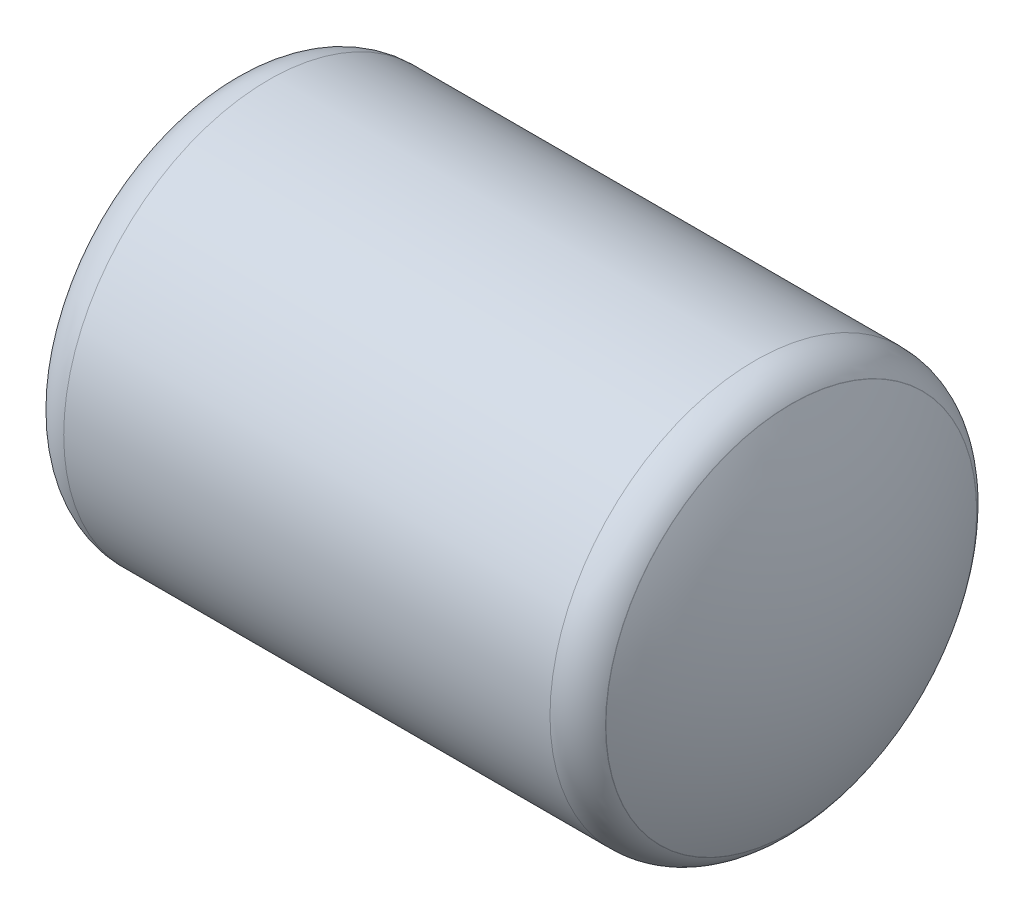
ISO-10303-21;
HEADER;
FILE_DESCRIPTION(('STEP AP214'),'2;1');
FILE_NAME('part.step','',(''),(''),'','','');
FILE_SCHEMA(('AUTOMOTIVE_DESIGN { 1 0 10303 214 1 1 1 1 }'));
ENDSEC;
DATA;
#1=APPLICATION_CONTEXT('core data for automotive mechanical design processes');
#2=APPLICATION_PROTOCOL_DEFINITION('international standard','automotive_design',2000,#1);
#3=PRODUCT_CONTEXT('',#1,'mechanical');
#4=PRODUCT('Part','Part','',(#3));
#5=PRODUCT_RELATED_PRODUCT_CATEGORY('part','',(#4));
#6=PRODUCT_DEFINITION_FORMATION('','',#4);
#7=PRODUCT_DEFINITION_CONTEXT('part definition',#1,'design');
#8=PRODUCT_DEFINITION('design','',#6,#7);
#9=PRODUCT_DEFINITION_SHAPE('','',#8);
#10=(LENGTH_UNIT() NAMED_UNIT(*) SI_UNIT(.MILLI.,.METRE.));
#11=(NAMED_UNIT(*) PLANE_ANGLE_UNIT() SI_UNIT($,.RADIAN.));
#12=(NAMED_UNIT(*) SI_UNIT($,.STERADIAN.) SOLID_ANGLE_UNIT());
#13=UNCERTAINTY_MEASURE_WITH_UNIT(LENGTH_MEASURE(1.E-05),#10,'distance_accuracy_value','');
#14=(GEOMETRIC_REPRESENTATION_CONTEXT(3) GLOBAL_UNCERTAINTY_ASSIGNED_CONTEXT((#13)) GLOBAL_UNIT_ASSIGNED_CONTEXT((#10,
#11,#12)) REPRESENTATION_CONTEXT('',''));
#15=CARTESIAN_POINT('',(0.,0.,0.));
#16=DIRECTION('',(0.,0.,1.));
#17=DIRECTION('',(1.,0.,0.));
#18=AXIS2_PLACEMENT_3D('',#15,#16,#17);
#19=CARTESIAN_POINT('',(24269.2202488997,4656.14444820347,0.));
#20=DIRECTION('',(-1.,0.,0.));
#21=DIRECTION('',(0.,1.,0.));
#22=AXIS2_PLACEMENT_3D('',#19,#20,#21);
#23=SPHERICAL_SURFACE('',#22,1308.);
#24=CARTESIAN_POINT('',(25434.2224775123,4656.14444820347,0.));
#25=DIRECTION('',(-1.,0.,0.));
#26=DIRECTION('',(0.,0.,1.));
#27=AXIS2_PLACEMENT_3D('',#24,#25,#26);
#28=CIRCLE('',#27,594.671175800313);
#29=CARTESIAN_POINT('',(25434.2224775123,4656.14444820347,594.671175800313));
#30=VERTEX_POINT('',#29);
#31=EDGE_CURVE('E66',#30,#30,#28,.T.);
#32=ORIENTED_EDGE('',*,*,#31,.F.);
#33=EDGE_LOOP('',(#32));
#34=FACE_BOUND('',#33,.T.);
#35=ADVANCED_FACE('F36',(#34),#23,.T.);
#36=CARTESIAN_POINT('',(25434.2224775123,4656.14444820347,0.));
#37=DIRECTION('',(-1.,0.,0.));
#38=DIRECTION('',(0.,0.,1.));
#39=AXIS2_PLACEMENT_3D('',#36,#37,#38);
#40=CONICAL_SURFACE('',#39,594.671175800313,1.04577216987342);
#41=CARTESIAN_POINT('',(25433.7971944018,4656.14444820347,0.));
#42=DIRECTION('',(-1.,0.,0.));
#43=DIRECTION('',(0.,0.,1.));
#44=AXIS2_PLACEMENT_3D('',#41,#42,#43);
#45=CIRCLE('',#44,595.405368962806);
#46=CARTESIAN_POINT('',(25433.7971944018,4656.14444820347,595.405368962806));
#47=VERTEX_POINT('',#46);
#48=EDGE_CURVE('E69',#47,#47,#45,.T.);
#49=ORIENTED_EDGE('',*,*,#48,.F.);
#50=EDGE_LOOP('',(#49));
#51=FACE_BOUND('',#50,.T.);
#52=ORIENTED_EDGE('',*,*,#31,.T.);
#53=EDGE_LOOP('',(#52));
#54=FACE_BOUND('',#53,.T.);
#55=ADVANCED_FACE('F133',(#51,#54),#40,.T.);
#56=CARTESIAN_POINT('',(25318.2202488998,4656.14444820347,0.));
#57=DIRECTION('',(-1.,0.,0.));
#58=DIRECTION('',(0.,0.,1.));
#59=AXIS2_PLACEMENT_3D('',#56,#57,#58);
#60=TOROIDAL_SURFACE('',#59,520.,137.999999999952);
#61=CARTESIAN_POINT('',(25318.2202488997,4656.14444820347,0.));
#62=DIRECTION('',(-1.,0.,0.));
#63=DIRECTION('',(0.,0.,1.));
#64=AXIS2_PLACEMENT_3D('',#61,#62,#63);
#65=CIRCLE('',#64,657.999999999952);
#66=CARTESIAN_POINT('',(25318.2202488997,4656.14444820347,657.999999999952));
#67=VERTEX_POINT('',#66);
#68=EDGE_CURVE('E72',#67,#67,#65,.T.);
#69=ORIENTED_EDGE('',*,*,#68,.F.);
#70=EDGE_LOOP('',(#69));
#71=FACE_BOUND('',#70,.T.);
#72=ORIENTED_EDGE('',*,*,#48,.T.);
#73=EDGE_LOOP('',(#72));
#74=FACE_BOUND('',#73,.T.);
#75=ADVANCED_FACE('F137',(#71,#74),#60,.T.);
#76=CARTESIAN_POINT('',(22663.2465688494,4656.14444820347,0.));
#77=DIRECTION('',(-1.,0.,0.));
#78=DIRECTION('',(0.,0.,1.));
#79=AXIS2_PLACEMENT_3D('',#76,#77,#78);
#80=CYLINDRICAL_SURFACE('',#79,658.);
#81=CARTESIAN_POINT('',(23758.2202488997,4656.14444820347,0.));
#82=DIRECTION('',(-1.,0.,0.));
#83=DIRECTION('',(0.,0.,1.));
#84=AXIS2_PLACEMENT_3D('',#81,#82,#83);
#85=CIRCLE('',#84,657.999999999999);
#86=CARTESIAN_POINT('',(23758.2202488997,4656.14444820347,657.999999999999));
#87=VERTEX_POINT('',#86);
#88=EDGE_CURVE('E75',#87,#87,#85,.T.);
#89=ORIENTED_EDGE('',*,*,#88,.F.);
#90=EDGE_LOOP('',(#89));
#91=FACE_BOUND('',#90,.T.);
#92=ORIENTED_EDGE('',*,*,#68,.T.);
#93=EDGE_LOOP('',(#92));
#94=FACE_BOUND('',#93,.T.);
#95=ADVANCED_FACE('F141',(#91,#94),#80,.T.);
#96=CARTESIAN_POINT('',(23758.2202488997,4656.14444820347,0.));
#97=DIRECTION('',(-1.,0.,0.));
#98=DIRECTION('',(0.,0.,1.));
#99=AXIS2_PLACEMENT_3D('',#96,#97,#98);
#100=TOROIDAL_SURFACE('',#99,520.,137.999999999999);
#101=CARTESIAN_POINT('',(23642.6433033977,4656.14444820347,0.));
#102=DIRECTION('',(-1.,0.,0.));
#103=DIRECTION('',(0.,0.,1.));
#104=AXIS2_PLACEMENT_3D('',#101,#102,#103);
#105=CIRCLE('',#104,595.40536896285);
#106=CARTESIAN_POINT('',(23642.6433033977,4656.14444820347,595.40536896285));
#107=VERTEX_POINT('',#106);
#108=EDGE_CURVE('E78',#107,#107,#105,.T.);
#109=ORIENTED_EDGE('',*,*,#108,.F.);
#110=EDGE_LOOP('',(#109));
#111=FACE_BOUND('',#110,.T.);
#112=ORIENTED_EDGE('',*,*,#88,.T.);
#113=EDGE_LOOP('',(#112));
#114=FACE_BOUND('',#113,.T.);
#115=ADVANCED_FACE('F145',(#111,#114),#100,.T.);
#116=CARTESIAN_POINT('',(23642.6433033977,4656.14444820347,0.));
#117=DIRECTION('',(1.,0.,0.));
#118=DIRECTION('',(0.,0.,-1.));
#119=AXIS2_PLACEMENT_3D('',#116,#117,#118);
#120=CONICAL_SURFACE('',#119,595.40536896285,1.04577216987057);
#121=CARTESIAN_POINT('',(23642.2180202867,4656.14444820347,0.));
#122=DIRECTION('',(-1.,0.,0.));
#123=DIRECTION('',(0.,0.,1.));
#124=AXIS2_PLACEMENT_3D('',#121,#122,#123);
#125=CIRCLE('',#124,594.671175799546);
#126=CARTESIAN_POINT('',(23642.2180202867,4656.14444820347,594.671175799546));
#127=VERTEX_POINT('',#126);
#128=EDGE_CURVE('E81',#127,#127,#125,.T.);
#129=ORIENTED_EDGE('',*,*,#128,.F.);
#130=EDGE_LOOP('',(#129));
#131=FACE_BOUND('',#130,.T.);
#132=ORIENTED_EDGE('',*,*,#108,.T.);
#133=EDGE_LOOP('',(#132));
#134=FACE_BOUND('',#133,.T.);
#135=ADVANCED_FACE('F149',(#131,#134),#120,.T.);
#136=CARTESIAN_POINT('',(24807.2202488997,4656.14444820347,0.));
#137=DIRECTION('',(-1.,0.,0.));
#138=DIRECTION('',(0.,1.,0.));
#139=AXIS2_PLACEMENT_3D('',#136,#137,#138);
#140=SPHERICAL_SURFACE('',#139,1308.);
#141=ORIENTED_EDGE('',*,*,#128,.T.);
#142=EDGE_LOOP('',(#141));
#143=FACE_BOUND('',#142,.T.);
#144=ADVANCED_FACE('F152',(#143),#140,.T.);
#145=CLOSED_SHELL('',(#35,#55,#75,#95,#115,#135,#144));
#146=CARTESIAN_POINT('',(23758.2202488997,4656.14444820347,0.));
#147=DIRECTION('',(-1.,0.,0.));
#148=DIRECTION('',(0.,0.,1.));
#149=AXIS2_PLACEMENT_3D('',#146,#147,#148);
#150=TOROIDAL_SURFACE('',#149,520.,130.000000000001);
#151=CARTESIAN_POINT('',(23758.2202488997,4656.14444820347,0.));
#152=DIRECTION('',(-1.,0.,0.));
#153=DIRECTION('',(0.,0.,1.));
#154=AXIS2_PLACEMENT_3D('',#151,#152,#153);
#155=CIRCLE('',#154,650.000000000001);
#156=CARTESIAN_POINT('',(23758.2202488997,4656.14444820347,650.000000000001));
#157=VERTEX_POINT('',#156);
#158=EDGE_CURVE('E10',#157,#157,#155,.T.);
#159=ORIENTED_EDGE('',*,*,#158,.F.);
#160=EDGE_LOOP('',(#159));
#161=FACE_BOUND('',#160,.T.);
#162=CARTESIAN_POINT('',(23649.3434161804,4656.14444820347,0.));
#163=DIRECTION('',(-1.,0.,0.));
#164=DIRECTION('',(0.,0.,1.));
#165=AXIS2_PLACEMENT_3D('',#162,#163,#164);
#166=CIRCLE('',#165,591.034043225847);
#167=CARTESIAN_POINT('',(23649.3434161804,4656.14444820347,591.034043225847));
#168=VERTEX_POINT('',#167);
#169=EDGE_CURVE('E84',#168,#168,#166,.T.);
#170=ORIENTED_EDGE('',*,*,#169,.T.);
#171=EDGE_LOOP('',(#170));
#172=FACE_BOUND('',#171,.T.);
#173=ADVANCED_FACE('F38',(#161,#172),#150,.F.);
#174=CARTESIAN_POINT('',(22663.2465688494,4656.14444820347,0.));
#175=DIRECTION('',(-1.,0.,0.));
#176=DIRECTION('',(0.,0.,1.));
#177=AXIS2_PLACEMENT_3D('',#174,#175,#176);
#178=CYLINDRICAL_SURFACE('',#177,650.);
#179=CARTESIAN_POINT('',(23788.2202488997,4656.14444820347,0.));
#180=DIRECTION('',(-1.,0.,0.));
#181=DIRECTION('',(0.,0.,1.));
#182=AXIS2_PLACEMENT_3D('',#179,#180,#181);
#183=CIRCLE('',#182,649.999999999999);
#184=CARTESIAN_POINT('',(23788.2202488997,4656.14444820347,649.999999999999));
#185=VERTEX_POINT('',#184);
#186=EDGE_CURVE('E44',#185,#185,#183,.T.);
#187=ORIENTED_EDGE('',*,*,#186,.F.);
#188=EDGE_LOOP('',(#187));
#189=FACE_BOUND('',#188,.T.);
#190=ORIENTED_EDGE('',*,*,#158,.T.);
#191=EDGE_LOOP('',(#190));
#192=FACE_BOUND('',#191,.T.);
#193=ADVANCED_FACE('F102',(#189,#192),#178,.F.);
#194=CARTESIAN_POINT('',(23788.2202488997,4656.14444820347,0.));
#195=DIRECTION('',(1.,0.,0.));
#196=DIRECTION('',(0.,0.,-1.));
#197=AXIS2_PLACEMENT_3D('',#194,#195,#196);
#198=CONICAL_SURFACE('',#197,649.999999999999,0.244978663127073);
#199=CARTESIAN_POINT('',(23796.2202488997,4656.14444820347,0.));
#200=DIRECTION('',(-1.,0.,0.));
#201=DIRECTION('',(0.,0.,1.));
#202=AXIS2_PLACEMENT_3D('',#199,#200,#201);
#203=CIRCLE('',#202,652.);
#204=CARTESIAN_POINT('',(23796.2202488997,4656.14444820347,652.));
#205=VERTEX_POINT('',#204);
#206=EDGE_CURVE('E48',#205,#205,#203,.T.);
#207=ORIENTED_EDGE('',*,*,#206,.F.);
#208=EDGE_LOOP('',(#207));
#209=FACE_BOUND('',#208,.T.);
#210=ORIENTED_EDGE('',*,*,#186,.T.);
#211=EDGE_LOOP('',(#210));
#212=FACE_BOUND('',#211,.T.);
#213=ADVANCED_FACE('F108',(#209,#212),#198,.F.);
#214=CARTESIAN_POINT('',(22663.2465688494,4656.14444820347,0.));
#215=DIRECTION('',(-1.,0.,0.));
#216=DIRECTION('',(0.,0.,1.));
#217=AXIS2_PLACEMENT_3D('',#214,#215,#216);
#218=CYLINDRICAL_SURFACE('',#217,652.);
#219=CARTESIAN_POINT('',(25280.2202488997,4656.14444820347,0.));
#220=DIRECTION('',(-1.,0.,0.));
#221=DIRECTION('',(0.,0.,1.));
#222=AXIS2_PLACEMENT_3D('',#219,#220,#221);
#223=CIRCLE('',#222,652.);
#224=CARTESIAN_POINT('',(25280.2202488997,4656.14444820347,652.));
#225=VERTEX_POINT('',#224);
#226=EDGE_CURVE('E52',#225,#225,#223,.T.);
#227=ORIENTED_EDGE('',*,*,#226,.F.);
#228=EDGE_LOOP('',(#227));
#229=FACE_BOUND('',#228,.T.);
#230=ORIENTED_EDGE('',*,*,#206,.T.);
#231=EDGE_LOOP('',(#230));
#232=FACE_BOUND('',#231,.T.);
#233=ADVANCED_FACE('F113',(#229,#232),#218,.F.);
#234=CARTESIAN_POINT('',(25280.2202488997,4656.14444820347,0.));
#235=DIRECTION('',(-1.,0.,0.));
#236=DIRECTION('',(0.,0.,1.));
#237=AXIS2_PLACEMENT_3D('',#234,#235,#236);
#238=CONICAL_SURFACE('',#237,652.,0.244978663126969);
#239=CARTESIAN_POINT('',(25288.2202488997,4656.14444820347,0.));
#240=DIRECTION('',(-1.,0.,0.));
#241=DIRECTION('',(0.,0.,1.));
#242=AXIS2_PLACEMENT_3D('',#239,#240,#241);
#243=CIRCLE('',#242,649.999999999999);
#244=CARTESIAN_POINT('',(25288.2202488997,4656.14444820347,649.999999999999));
#245=VERTEX_POINT('',#244);
#246=EDGE_CURVE('E57',#245,#245,#243,.T.);
#247=ORIENTED_EDGE('',*,*,#246,.F.);
#248=EDGE_LOOP('',(#247));
#249=FACE_BOUND('',#248,.T.);
#250=ORIENTED_EDGE('',*,*,#226,.T.);
#251=EDGE_LOOP('',(#250));
#252=FACE_BOUND('',#251,.T.);
#253=ADVANCED_FACE('F119',(#249,#252),#238,.F.);
#254=CARTESIAN_POINT('',(22663.2465688494,4656.14444820347,0.));
#255=DIRECTION('',(-1.,0.,0.));
#256=DIRECTION('',(0.,0.,1.));
#257=AXIS2_PLACEMENT_3D('',#254,#255,#256);
#258=CYLINDRICAL_SURFACE('',#257,649.999999999999);
#259=CARTESIAN_POINT('',(25318.2202488997,4656.14444820347,0.));
#260=DIRECTION('',(-1.,0.,0.));
#261=DIRECTION('',(0.,0.,1.));
#262=AXIS2_PLACEMENT_3D('',#259,#260,#261);
#263=CIRCLE('',#262,649.999999999999);
#264=CARTESIAN_POINT('',(25318.2202488997,4656.14444820347,649.999999999999));
#265=VERTEX_POINT('',#264);
#266=EDGE_CURVE('E60',#265,#265,#263,.T.);
#267=ORIENTED_EDGE('',*,*,#266,.F.);
#268=EDGE_LOOP('',(#267));
#269=FACE_BOUND('',#268,.T.);
#270=ORIENTED_EDGE('',*,*,#246,.T.);
#271=EDGE_LOOP('',(#270));
#272=FACE_BOUND('',#271,.T.);
#273=ADVANCED_FACE('F123',(#269,#272),#258,.F.);
#274=CARTESIAN_POINT('',(25318.2202488998,4656.14444820347,0.));
#275=DIRECTION('',(-1.,0.,0.));
#276=DIRECTION('',(0.,0.,1.));
#277=AXIS2_PLACEMENT_3D('',#274,#275,#276);
#278=TOROIDAL_SURFACE('',#277,520.,130.);
#279=CARTESIAN_POINT('',(25427.0970816186,4656.14444820347,0.));
#280=DIRECTION('',(-1.,0.,0.));
#281=DIRECTION('',(0.,0.,1.));
#282=AXIS2_PLACEMENT_3D('',#279,#280,#281);
#283=CIRCLE('',#282,591.034043226611);
#284=CARTESIAN_POINT('',(25427.0970816186,4656.14444820347,591.034043226611));
#285=VERTEX_POINT('',#284);
#286=EDGE_CURVE('E63',#285,#285,#283,.T.);
#287=ORIENTED_EDGE('',*,*,#286,.F.);
#288=EDGE_LOOP('',(#287));
#289=FACE_BOUND('',#288,.T.);
#290=ORIENTED_EDGE('',*,*,#266,.T.);
#291=EDGE_LOOP('',(#290));
#292=FACE_BOUND('',#291,.T.);
#293=ADVANCED_FACE('F97',(#289,#292),#278,.F.);
#294=CARTESIAN_POINT('',(24269.2202488997,4656.14444820347,0.));
#295=DIRECTION('',(-1.,0.,0.));
#296=DIRECTION('',(0.,1.,0.));
#297=AXIS2_PLACEMENT_3D('',#294,#295,#296);
#298=SPHERICAL_SURFACE('',#297,1300.);
#299=ORIENTED_EDGE('',*,*,#286,.T.);
#300=EDGE_LOOP('',(#299));
#301=FACE_BOUND('',#300,.T.);
#302=ADVANCED_FACE('F91',(#301),#298,.F.);
#303=CARTESIAN_POINT('',(24807.2202488997,4656.14444820347,0.));
#304=DIRECTION('',(-1.,0.,0.));
#305=DIRECTION('',(0.,-1.,0.));
#306=AXIS2_PLACEMENT_3D('',#303,#304,#305);
#307=SPHERICAL_SURFACE('',#306,1300.);
#308=ORIENTED_EDGE('',*,*,#169,.F.);
#309=EDGE_LOOP('',(#308));
#310=FACE_BOUND('',#309,.T.);
#311=ADVANCED_FACE('F89',(#310),#307,.F.);
#312=CLOSED_SHELL('',(#173,#193,#213,#233,#253,#273,#293,#302,#311));
#313=ORIENTED_CLOSED_SHELL('',*,#312,.T.);
#314=BREP_WITH_VOIDS('B2',#145,(#313));
#315=ADVANCED_BREP_SHAPE_REPRESENTATION('',(#18,#314),#14);
#316=SHAPE_DEFINITION_REPRESENTATION(#9,#315);
ENDSEC;
END-ISO-10303-21;
